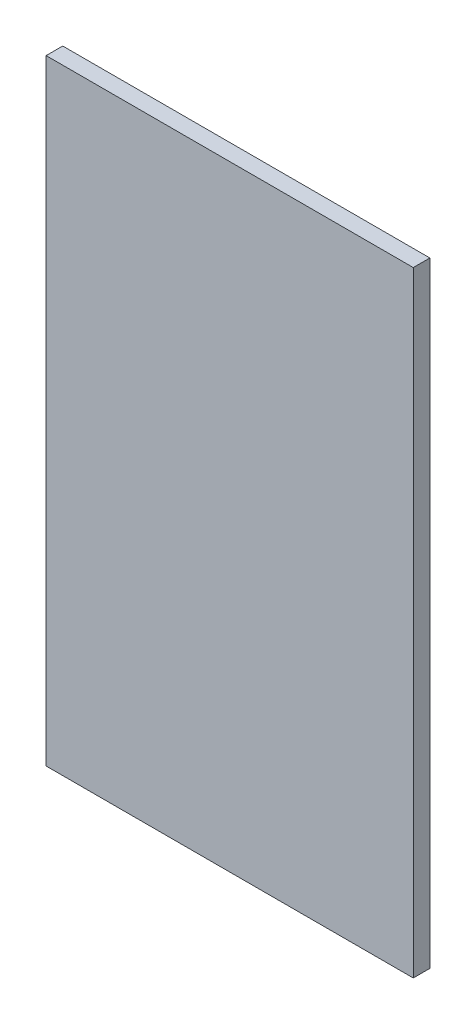
ISO-10303-21;
HEADER;
FILE_DESCRIPTION(('STEP AP214'),'2;1');
FILE_NAME('part.step','',(''),(''),'','','');
FILE_SCHEMA(('AUTOMOTIVE_DESIGN { 1 0 10303 214 1 1 1 1 }'));
ENDSEC;
DATA;
#1=APPLICATION_CONTEXT('core data for automotive mechanical design processes');
#2=APPLICATION_PROTOCOL_DEFINITION('international standard','automotive_design',2000,#1);
#3=PRODUCT_CONTEXT('',#1,'mechanical');
#4=PRODUCT('Part','Part','',(#3));
#5=PRODUCT_RELATED_PRODUCT_CATEGORY('part','',(#4));
#6=PRODUCT_DEFINITION_FORMATION('','',#4);
#7=PRODUCT_DEFINITION_CONTEXT('part definition',#1,'design');
#8=PRODUCT_DEFINITION('design','',#6,#7);
#9=PRODUCT_DEFINITION_SHAPE('','',#8);
#10=(LENGTH_UNIT() NAMED_UNIT(*) SI_UNIT(.MILLI.,.METRE.));
#11=(NAMED_UNIT(*) PLANE_ANGLE_UNIT() SI_UNIT($,.RADIAN.));
#12=(NAMED_UNIT(*) SI_UNIT($,.STERADIAN.) SOLID_ANGLE_UNIT());
#13=UNCERTAINTY_MEASURE_WITH_UNIT(LENGTH_MEASURE(1.E-05),#10,'distance_accuracy_value','');
#14=(GEOMETRIC_REPRESENTATION_CONTEXT(3) GLOBAL_UNCERTAINTY_ASSIGNED_CONTEXT((#13)) GLOBAL_UNIT_ASSIGNED_CONTEXT((#10,
#11,#12)) REPRESENTATION_CONTEXT('',''));
#15=CARTESIAN_POINT('',(0.,0.,0.));
#16=DIRECTION('',(0.,0.,1.));
#17=DIRECTION('',(1.,0.,0.));
#18=AXIS2_PLACEMENT_3D('',#15,#16,#17);
#19=CARTESIAN_POINT('',(-199.,-333.5,18.));
#20=DIRECTION('',(1.,0.,0.));
#21=DIRECTION('',(0.,0.,-1.));
#22=AXIS2_PLACEMENT_3D('',#19,#20,#21);
#23=PLANE('',#22);
#24=DIRECTION('',(0.,-1.,0.));
#25=VECTOR('',#24,1.);
#26=CARTESIAN_POINT('',(-199.,-333.5,0.));
#27=LINE('',#26,#25);
#28=CARTESIAN_POINT('',(-199.,333.5,0.));
#29=VERTEX_POINT('',#28);
#30=CARTESIAN_POINT('',(-199.,-333.5,0.));
#31=VERTEX_POINT('',#30);
#32=EDGE_CURVE('E96',#29,#31,#27,.T.);
#33=ORIENTED_EDGE('',*,*,#32,.T.);
#34=DIRECTION('',(0.,0.,-1.));
#35=VECTOR('',#34,1.);
#36=CARTESIAN_POINT('',(-199.,-333.5,18.));
#37=LINE('',#36,#35);
#38=CARTESIAN_POINT('',(-199.,-333.5,18.));
#39=VERTEX_POINT('',#38);
#40=EDGE_CURVE('E11',#39,#31,#37,.T.);
#41=ORIENTED_EDGE('',*,*,#40,.F.);
#42=DIRECTION('',(0.,-1.,0.));
#43=VECTOR('',#42,1.);
#44=CARTESIAN_POINT('',(-199.,-333.5,18.));
#45=LINE('',#44,#43);
#46=CARTESIAN_POINT('',(-199.,333.5,18.));
#47=VERTEX_POINT('',#46);
#48=EDGE_CURVE('E84',#47,#39,#45,.T.);
#49=ORIENTED_EDGE('',*,*,#48,.F.);
#50=DIRECTION('',(0.,0.,-1.));
#51=VECTOR('',#50,1.);
#52=CARTESIAN_POINT('',(-199.,333.5,18.));
#53=LINE('',#52,#51);
#54=EDGE_CURVE('E92',#47,#29,#53,.T.);
#55=ORIENTED_EDGE('',*,*,#54,.T.);
#56=EDGE_LOOP('',(#33,#41,#49,#55));
#57=FACE_BOUND('',#56,.T.);
#58=ADVANCED_FACE('F33',(#57),#23,.F.);
#59=CARTESIAN_POINT('',(199.,-333.5,18.));
#60=DIRECTION('',(0.,1.,0.));
#61=DIRECTION('',(-1.,0.,0.));
#62=AXIS2_PLACEMENT_3D('',#59,#60,#61);
#63=PLANE('',#62);
#64=DIRECTION('',(1.,0.,0.));
#65=VECTOR('',#64,1.);
#66=CARTESIAN_POINT('',(199.,-333.5,0.));
#67=LINE('',#66,#65);
#68=CARTESIAN_POINT('',(199.,-333.5,0.));
#69=VERTEX_POINT('',#68);
#70=EDGE_CURVE('E88',#31,#69,#67,.T.);
#71=ORIENTED_EDGE('',*,*,#70,.T.);
#72=DIRECTION('',(0.,0.,-1.));
#73=VECTOR('',#72,1.);
#74=CARTESIAN_POINT('',(199.,-333.5,18.));
#75=LINE('',#74,#73);
#76=CARTESIAN_POINT('',(199.,-333.5,18.));
#77=VERTEX_POINT('',#76);
#78=EDGE_CURVE('E41',#77,#69,#75,.T.);
#79=ORIENTED_EDGE('',*,*,#78,.F.);
#80=DIRECTION('',(1.,0.,0.));
#81=VECTOR('',#80,1.);
#82=CARTESIAN_POINT('',(199.,-333.5,18.));
#83=LINE('',#82,#81);
#84=EDGE_CURVE('E79',#39,#77,#83,.T.);
#85=ORIENTED_EDGE('',*,*,#84,.F.);
#86=ORIENTED_EDGE('',*,*,#40,.T.);
#87=EDGE_LOOP('',(#71,#79,#85,#86));
#88=FACE_BOUND('',#87,.T.);
#89=ADVANCED_FACE('F87',(#88),#63,.F.);
#90=CARTESIAN_POINT('',(199.,-333.5,18.));
#91=DIRECTION('',(-1.,0.,0.));
#92=DIRECTION('',(0.,0.,1.));
#93=AXIS2_PLACEMENT_3D('',#90,#91,#92);
#94=PLANE('',#93);
#95=DIRECTION('',(0.,1.,0.));
#96=VECTOR('',#95,1.);
#97=CARTESIAN_POINT('',(199.,-333.5,0.));
#98=LINE('',#97,#96);
#99=CARTESIAN_POINT('',(199.,333.5,0.));
#100=VERTEX_POINT('',#99);
#101=EDGE_CURVE('E66',#69,#100,#98,.T.);
#102=ORIENTED_EDGE('',*,*,#101,.T.);
#103=DIRECTION('',(0.,0.,-1.));
#104=VECTOR('',#103,1.);
#105=CARTESIAN_POINT('',(199.,333.5,18.));
#106=LINE('',#105,#104);
#107=CARTESIAN_POINT('',(199.,333.5,18.));
#108=VERTEX_POINT('',#107);
#109=EDGE_CURVE('E89',#108,#100,#106,.T.);
#110=ORIENTED_EDGE('',*,*,#109,.F.);
#111=DIRECTION('',(0.,1.,0.));
#112=VECTOR('',#111,1.);
#113=CARTESIAN_POINT('',(199.,-333.5,18.));
#114=LINE('',#113,#112);
#115=EDGE_CURVE('E82',#77,#108,#114,.T.);
#116=ORIENTED_EDGE('',*,*,#115,.F.);
#117=ORIENTED_EDGE('',*,*,#78,.T.);
#118=EDGE_LOOP('',(#102,#110,#116,#117));
#119=FACE_BOUND('',#118,.T.);
#120=ADVANCED_FACE('F90',(#119),#94,.F.);
#121=CARTESIAN_POINT('',(199.,333.5,18.));
#122=DIRECTION('',(0.,-1.,0.));
#123=DIRECTION('',(0.,0.,-1.));
#124=AXIS2_PLACEMENT_3D('',#121,#122,#123);
#125=PLANE('',#124);
#126=DIRECTION('',(-1.,0.,0.));
#127=VECTOR('',#126,1.);
#128=CARTESIAN_POINT('',(199.,333.5,0.));
#129=LINE('',#128,#127);
#130=EDGE_CURVE('E72',#100,#29,#129,.T.);
#131=ORIENTED_EDGE('',*,*,#130,.T.);
#132=ORIENTED_EDGE('',*,*,#54,.F.);
#133=DIRECTION('',(-1.,0.,0.));
#134=VECTOR('',#133,1.);
#135=CARTESIAN_POINT('',(199.,333.5,18.));
#136=LINE('',#135,#134);
#137=EDGE_CURVE('E49',#108,#47,#136,.T.);
#138=ORIENTED_EDGE('',*,*,#137,.F.);
#139=ORIENTED_EDGE('',*,*,#109,.T.);
#140=EDGE_LOOP('',(#131,#132,#138,#139));
#141=FACE_BOUND('',#140,.T.);
#142=ADVANCED_FACE('F103',(#141),#125,.F.);
#143=CARTESIAN_POINT('',(0.,0.,18.));
#144=DIRECTION('',(0.,0.,1.));
#145=DIRECTION('',(1.,0.,0.));
#146=AXIS2_PLACEMENT_3D('',#143,#144,#145);
#147=PLANE('',#146);
#148=ORIENTED_EDGE('',*,*,#48,.T.);
#149=ORIENTED_EDGE('',*,*,#84,.T.);
#150=ORIENTED_EDGE('',*,*,#115,.T.);
#151=ORIENTED_EDGE('',*,*,#137,.T.);
#152=EDGE_LOOP('',(#148,#149,#150,#151));
#153=FACE_BOUND('',#152,.T.);
#154=ADVANCED_FACE('F80',(#153),#147,.T.);
#155=CARTESIAN_POINT('',(0.,0.,0.));
#156=DIRECTION('',(0.,0.,1.));
#157=DIRECTION('',(1.,0.,0.));
#158=AXIS2_PLACEMENT_3D('',#155,#156,#157);
#159=PLANE('',#158);
#160=ORIENTED_EDGE('',*,*,#32,.F.);
#161=ORIENTED_EDGE('',*,*,#130,.F.);
#162=ORIENTED_EDGE('',*,*,#101,.F.);
#163=ORIENTED_EDGE('',*,*,#70,.F.);
#164=EDGE_LOOP('',(#160,#161,#162,#163));
#165=FACE_BOUND('',#164,.T.);
#166=ADVANCED_FACE('F106',(#165),#159,.F.);
#167=CLOSED_SHELL('',(#58,#89,#120,#142,#154,#166));
#168=MANIFOLD_SOLID_BREP('B2',#167);
#169=ADVANCED_BREP_SHAPE_REPRESENTATION('',(#18,#168),#14);
#170=SHAPE_DEFINITION_REPRESENTATION(#9,#169);
ENDSEC;
END-ISO-10303-21;
